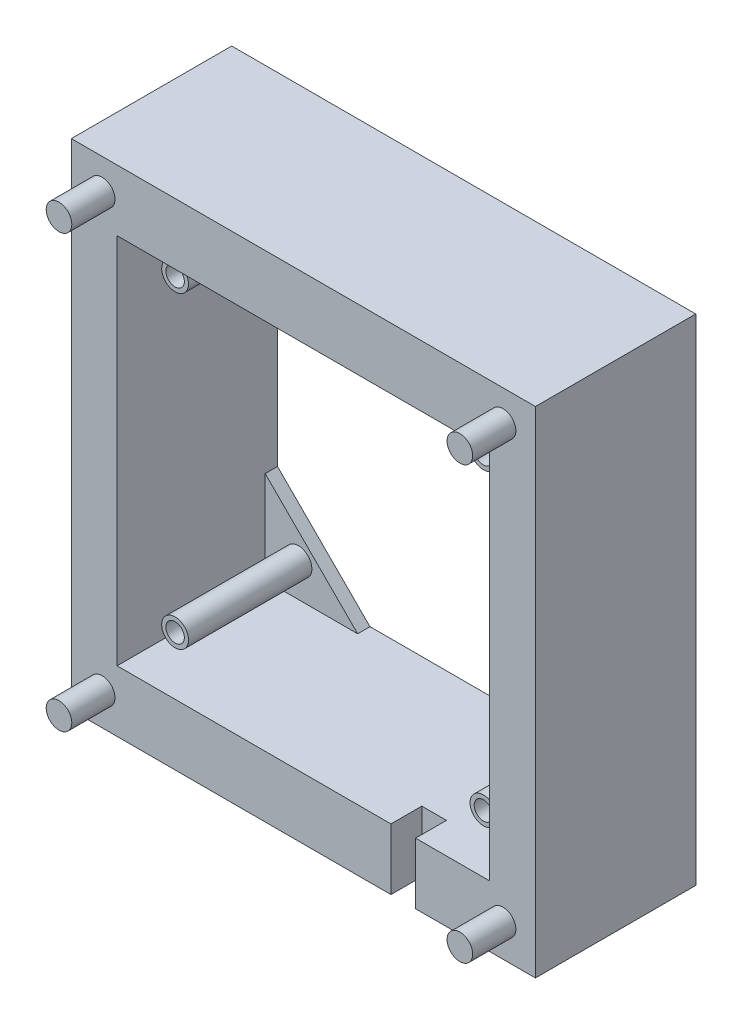
ISO-10303-21;
HEADER;
FILE_DESCRIPTION(('STEP AP214'),'2;1');
FILE_NAME('part.step','',(''),(''),'','','');
FILE_SCHEMA(('AUTOMOTIVE_DESIGN { 1 0 10303 214 1 1 1 1 }'));
ENDSEC;
DATA;
#1=APPLICATION_CONTEXT('core data for automotive mechanical design processes');
#2=APPLICATION_PROTOCOL_DEFINITION('international standard','automotive_design',2000,#1);
#3=PRODUCT_CONTEXT('',#1,'mechanical');
#4=PRODUCT('Part','Part','',(#3));
#5=PRODUCT_RELATED_PRODUCT_CATEGORY('part','',(#4));
#6=PRODUCT_DEFINITION_FORMATION('','',#4);
#7=PRODUCT_DEFINITION_CONTEXT('part definition',#1,'design');
#8=PRODUCT_DEFINITION('design','',#6,#7);
#9=PRODUCT_DEFINITION_SHAPE('','',#8);
#10=(LENGTH_UNIT() NAMED_UNIT(*) SI_UNIT(.MILLI.,.METRE.));
#11=(NAMED_UNIT(*) PLANE_ANGLE_UNIT() SI_UNIT($,.RADIAN.));
#12=(NAMED_UNIT(*) SI_UNIT($,.STERADIAN.) SOLID_ANGLE_UNIT());
#13=UNCERTAINTY_MEASURE_WITH_UNIT(LENGTH_MEASURE(1.E-05),#10,'distance_accuracy_value','');
#14=(GEOMETRIC_REPRESENTATION_CONTEXT(3) GLOBAL_UNCERTAINTY_ASSIGNED_CONTEXT((#13)) GLOBAL_UNIT_ASSIGNED_CONTEXT((#10,
#11,#12)) REPRESENTATION_CONTEXT('',''));
#15=CARTESIAN_POINT('',(0.,0.,0.));
#16=DIRECTION('',(0.,0.,1.));
#17=DIRECTION('',(1.,0.,0.));
#18=AXIS2_PLACEMENT_3D('',#15,#16,#17);
#19=CARTESIAN_POINT('',(-95.8163043478265,-19.8431159420271,-2.));
#20=DIRECTION('',(-0.707106781186543,-0.707106781186552,0.));
#21=DIRECTION('',(0.707106781186552,-0.707106781186543,0.));
#22=AXIS2_PLACEMENT_3D('',#19,#20,#21);
#23=PLANE('',#22);
#24=DIRECTION('',(0.,0.,1.));
#25=VECTOR('',#24,1.);
#26=CARTESIAN_POINT('',(-88.3913043478261,-27.2681159420274,-2.));
#27=LINE('',#26,#25);
#28=CARTESIAN_POINT('',(-88.3913043478261,-27.2681159420274,-2.));
#29=VERTEX_POINT('',#28);
#30=CARTESIAN_POINT('',(-88.3913043478261,-27.2681159420274,0.));
#31=VERTEX_POINT('',#30);
#32=EDGE_CURVE('E177',#29,#31,#27,.T.);
#33=ORIENTED_EDGE('',*,*,#32,.T.);
#34=DIRECTION('',(0.707106781186552,-0.707106781186543,0.));
#35=VECTOR('',#34,1.);
#36=CARTESIAN_POINT('',(-95.8163043478265,-19.8431159420271,0.));
#37=LINE('',#36,#35);
#38=CARTESIAN_POINT('',(-73.3913043478243,-42.268115942029,0.));
#39=VERTEX_POINT('',#38);
#40=EDGE_CURVE('E384',#31,#39,#37,.T.);
#41=ORIENTED_EDGE('',*,*,#40,.T.);
#42=DIRECTION('',(0.,0.,1.));
#43=VECTOR('',#42,1.);
#44=CARTESIAN_POINT('',(-73.3913043478243,-42.268115942029,-2.));
#45=LINE('',#44,#43);
#46=CARTESIAN_POINT('',(-73.3913043478243,-42.268115942029,-2.));
#47=VERTEX_POINT('',#46);
#48=EDGE_CURVE('E913',#47,#39,#45,.T.);
#49=ORIENTED_EDGE('',*,*,#48,.F.);
#50=DIRECTION('',(0.707106781186552,-0.707106781186543,0.));
#51=VECTOR('',#50,1.);
#52=CARTESIAN_POINT('',(-95.8163043478265,-19.8431159420271,-2.));
#53=LINE('',#52,#51);
#54=EDGE_CURVE('E385',#29,#47,#53,.T.);
#55=ORIENTED_EDGE('',*,*,#54,.F.);
#56=EDGE_LOOP('',(#33,#41,#49,#55));
#57=FACE_BOUND('',#56,.T.);
#58=ADVANCED_FACE('F33',(#57),#23,.F.);
#59=CARTESIAN_POINT('',(-63.4663043478264,28.056884057971,-2.));
#60=DIRECTION('',(-0.707106781186552,0.707106781186543,0.));
#61=DIRECTION('',(-0.707106781186543,-0.707106781186552,0.));
#62=AXIS2_PLACEMENT_3D('',#59,#60,#61);
#63=PLANE('',#62);
#64=DIRECTION('',(0.,0.,1.));
#65=VECTOR('',#64,1.);
#66=CARTESIAN_POINT('',(-88.3913043478261,3.13188405797091,-2.));
#67=LINE('',#66,#65);
#68=CARTESIAN_POINT('',(-88.3913043478261,3.13188405797091,-2.));
#69=VERTEX_POINT('',#68);
#70=CARTESIAN_POINT('',(-88.3913043478261,3.13188405797091,0.));
#71=VERTEX_POINT('',#70);
#72=EDGE_CURVE('E174',#69,#71,#67,.T.);
#73=ORIENTED_EDGE('',*,*,#72,.F.);
#74=DIRECTION('',(-0.707106781186543,-0.707106781186552,0.));
#75=VECTOR('',#74,1.);
#76=CARTESIAN_POINT('',(-63.4663043478264,28.056884057971,-2.));
#77=LINE('',#76,#75);
#78=CARTESIAN_POINT('',(-73.3913043478262,18.131884057971,-2.));
#79=VERTEX_POINT('',#78);
#80=EDGE_CURVE('E186',#79,#69,#77,.T.);
#81=ORIENTED_EDGE('',*,*,#80,.F.);
#82=DIRECTION('',(0.,0.,1.));
#83=VECTOR('',#82,1.);
#84=CARTESIAN_POINT('',(-73.3913043478262,18.131884057971,-2.));
#85=LINE('',#84,#83);
#86=CARTESIAN_POINT('',(-73.3913043478262,18.131884057971,0.));
#87=VERTEX_POINT('',#86);
#88=EDGE_CURVE('E330',#79,#87,#85,.T.);
#89=ORIENTED_EDGE('',*,*,#88,.T.);
#90=DIRECTION('',(-0.707106781186543,-0.707106781186552,0.));
#91=VECTOR('',#90,1.);
#92=CARTESIAN_POINT('',(-63.4663043478264,28.056884057971,0.));
#93=LINE('',#92,#91);
#94=EDGE_CURVE('E188',#87,#71,#93,.T.);
#95=ORIENTED_EDGE('',*,*,#94,.T.);
#96=EDGE_LOOP('',(#73,#81,#89,#95));
#97=FACE_BOUND('',#96,.T.);
#98=ADVANCED_FACE('F185',(#97),#63,.F.);
#99=CARTESIAN_POINT('',(-52.9163043478261,-52.193115942029,-2.));
#100=DIRECTION('',(0.707106781186548,-0.707106781186547,0.));
#101=DIRECTION('',(0.707106781186547,0.707106781186548,0.));
#102=AXIS2_PLACEMENT_3D('',#99,#100,#101);
#103=PLANE('',#102);
#104=DIRECTION('',(0.,0.,1.));
#105=VECTOR('',#104,1.);
#106=CARTESIAN_POINT('',(-42.9913043478261,-42.268115942029,-2.));
#107=LINE('',#106,#105);
#108=CARTESIAN_POINT('',(-42.9913043478261,-42.268115942029,-2.));
#109=VERTEX_POINT('',#108);
#110=CARTESIAN_POINT('',(-42.9913043478261,-42.268115942029,0.));
#111=VERTEX_POINT('',#110);
#112=EDGE_CURVE('E918',#109,#111,#107,.T.);
#113=ORIENTED_EDGE('',*,*,#112,.T.);
#114=DIRECTION('',(0.707106781186548,0.707106781186548,0.));
#115=VECTOR('',#114,1.);
#116=CARTESIAN_POINT('',(-52.9163043478261,-52.193115942029,0.));
#117=LINE('',#116,#115);
#118=CARTESIAN_POINT('',(-27.9913043478261,-27.2681159420289,0.));
#119=VERTEX_POINT('',#118);
#120=EDGE_CURVE('E210',#111,#119,#117,.T.);
#121=ORIENTED_EDGE('',*,*,#120,.T.);
#122=DIRECTION('',(0.,0.,1.));
#123=VECTOR('',#122,1.);
#124=CARTESIAN_POINT('',(-27.9913043478261,-27.2681159420289,-2.));
#125=LINE('',#124,#123);
#126=CARTESIAN_POINT('',(-27.9913043478261,-27.2681159420289,-2.));
#127=VERTEX_POINT('',#126);
#128=EDGE_CURVE('E923',#127,#119,#125,.T.);
#129=ORIENTED_EDGE('',*,*,#128,.F.);
#130=DIRECTION('',(0.707106781186548,0.707106781186548,0.));
#131=VECTOR('',#130,1.);
#132=CARTESIAN_POINT('',(-52.9163043478261,-52.193115942029,-2.));
#133=LINE('',#132,#131);
#134=EDGE_CURVE('E214',#109,#127,#133,.T.);
#135=ORIENTED_EDGE('',*,*,#134,.F.);
#136=EDGE_LOOP('',(#113,#121,#129,#135));
#137=FACE_BOUND('',#136,.T.);
#138=ADVANCED_FACE('F448',(#137),#103,.F.);
#139=CARTESIAN_POINT('',(-20.5663043478261,-4.29311594202901,-2.));
#140=DIRECTION('',(0.707106781186547,0.707106781186547,0.));
#141=DIRECTION('',(-0.707106781186548,0.707106781186548,0.));
#142=AXIS2_PLACEMENT_3D('',#139,#140,#141);
#143=PLANE('',#142);
#144=DIRECTION('',(0.,0.,1.));
#145=VECTOR('',#144,1.);
#146=CARTESIAN_POINT('',(-27.9913043478261,3.13188405797101,-2.));
#147=LINE('',#146,#145);
#148=CARTESIAN_POINT('',(-27.9913043478261,3.13188405797101,-2.));
#149=VERTEX_POINT('',#148);
#150=CARTESIAN_POINT('',(-27.9913043478261,3.13188405797101,0.));
#151=VERTEX_POINT('',#150);
#152=EDGE_CURVE('E48',#149,#151,#147,.T.);
#153=ORIENTED_EDGE('',*,*,#152,.T.);
#154=DIRECTION('',(-0.707106781186548,0.707106781186548,0.));
#155=VECTOR('',#154,1.);
#156=CARTESIAN_POINT('',(-20.5663043478261,-4.29311594202901,0.));
#157=LINE('',#156,#155);
#158=CARTESIAN_POINT('',(-42.9913043478261,18.131884057971,0.));
#159=VERTEX_POINT('',#158);
#160=EDGE_CURVE('E395',#151,#159,#157,.T.);
#161=ORIENTED_EDGE('',*,*,#160,.T.);
#162=DIRECTION('',(0.,0.,1.));
#163=VECTOR('',#162,1.);
#164=CARTESIAN_POINT('',(-42.9913043478261,18.131884057971,-2.));
#165=LINE('',#164,#163);
#166=CARTESIAN_POINT('',(-42.9913043478261,18.131884057971,-2.));
#167=VERTEX_POINT('',#166);
#168=EDGE_CURVE('E925',#167,#159,#165,.T.);
#169=ORIENTED_EDGE('',*,*,#168,.F.);
#170=DIRECTION('',(-0.707106781186548,0.707106781186548,0.));
#171=VECTOR('',#170,1.);
#172=CARTESIAN_POINT('',(-20.5663043478261,-4.29311594202901,-2.));
#173=LINE('',#172,#171);
#174=EDGE_CURVE('E396',#149,#167,#173,.T.);
#175=ORIENTED_EDGE('',*,*,#174,.F.);
#176=EDGE_LOOP('',(#153,#161,#169,#175));
#177=FACE_BOUND('',#176,.T.);
#178=ADVANCED_FACE('F462',(#177),#143,.F.);
#179=CARTESIAN_POINT('',(0.,0.,0.));
#180=DIRECTION('',(0.,0.,1.));
#181=DIRECTION('',(1.,0.,0.));
#182=AXIS2_PLACEMENT_3D('',#179,#180,#181);
#183=PLANE('',#182);
#184=ORIENTED_EDGE('',*,*,#40,.F.);
#185=DIRECTION('',(0.,-1.,0.));
#186=VECTOR('',#185,1.);
#187=CARTESIAN_POINT('',(-88.3913043478261,18.131884057971,0.));
#188=LINE('',#187,#186);
#189=CARTESIAN_POINT('',(-88.3913043478261,-42.268115942029,0.));
#190=VERTEX_POINT('',#189);
#191=EDGE_CURVE('E387',#31,#190,#188,.T.);
#192=ORIENTED_EDGE('',*,*,#191,.T.);
#193=DIRECTION('',(1.,0.,0.));
#194=VECTOR('',#193,1.);
#195=CARTESIAN_POINT('',(-88.3913043478261,-42.268115942029,0.));
#196=LINE('',#195,#194);
#197=EDGE_CURVE('E261',#190,#39,#196,.T.);
#198=ORIENTED_EDGE('',*,*,#197,.T.);
#199=EDGE_LOOP('',(#184,#192,#198));
#200=FACE_BOUND('',#199,.T.);
#201=CARTESIAN_POINT('',(-82.9913043478256,-36.868115942029,0.));
#202=DIRECTION('',(0.,0.,1.));
#203=DIRECTION('',(1.,0.,0.));
#204=AXIS2_PLACEMENT_3D('',#201,#202,#203);
#205=CIRCLE('',#204,2.175);
#206=CARTESIAN_POINT('',(-80.8163043478256,-36.868115942029,0.));
#207=VERTEX_POINT('',#206);
#208=EDGE_CURVE('E348',#207,#207,#205,.T.);
#209=ORIENTED_EDGE('',*,*,#208,.F.);
#210=EDGE_LOOP('',(#209));
#211=FACE_BOUND('',#210,.T.);
#212=ADVANCED_FACE('F452',(#200,#211),#183,.T.);
#213=CARTESIAN_POINT('',(0.,0.,0.));
#214=DIRECTION('',(0.,0.,1.));
#215=DIRECTION('',(1.,0.,0.));
#216=AXIS2_PLACEMENT_3D('',#213,#214,#215);
#217=PLANE('',#216);
#218=ORIENTED_EDGE('',*,*,#120,.F.);
#219=CARTESIAN_POINT('',(-27.9913043478261,-42.268115942029,0.));
#220=VERTEX_POINT('',#219);
#221=EDGE_CURVE('E260',#111,#220,#196,.T.);
#222=ORIENTED_EDGE('',*,*,#221,.T.);
#223=DIRECTION('',(0.,1.,0.));
#224=VECTOR('',#223,1.);
#225=CARTESIAN_POINT('',(-27.9913043478261,18.131884057971,0.));
#226=LINE('',#225,#224);
#227=EDGE_CURVE('E264',#220,#119,#226,.T.);
#228=ORIENTED_EDGE('',*,*,#227,.T.);
#229=EDGE_LOOP('',(#218,#222,#228));
#230=FACE_BOUND('',#229,.T.);
#231=CARTESIAN_POINT('',(-32.9913043478256,-36.8681159420283,0.));
#232=DIRECTION('',(0.,0.,1.));
#233=DIRECTION('',(1.,0.,0.));
#234=AXIS2_PLACEMENT_3D('',#231,#232,#233);
#235=CIRCLE('',#234,2.175);
#236=CARTESIAN_POINT('',(-30.8163043478256,-36.8681159420283,0.));
#237=VERTEX_POINT('',#236);
#238=EDGE_CURVE('E357',#237,#237,#235,.T.);
#239=ORIENTED_EDGE('',*,*,#238,.F.);
#240=EDGE_LOOP('',(#239));
#241=FACE_BOUND('',#240,.T.);
#242=ADVANCED_FACE('F460',(#230,#241),#217,.T.);
#243=CARTESIAN_POINT('',(0.,0.,0.));
#244=DIRECTION('',(0.,0.,1.));
#245=DIRECTION('',(1.,0.,0.));
#246=AXIS2_PLACEMENT_3D('',#243,#244,#245);
#247=PLANE('',#246);
#248=ORIENTED_EDGE('',*,*,#160,.F.);
#249=DIRECTION('',(0.,1.,0.));
#250=VECTOR('',#249,1.);
#251=CARTESIAN_POINT('',(-27.9913043478261,18.131884057971,0.));
#252=LINE('',#251,#250);
#253=CARTESIAN_POINT('',(-27.9913043478261,18.131884057971,0.));
#254=VERTEX_POINT('',#253);
#255=EDGE_CURVE('E398',#151,#254,#252,.T.);
#256=ORIENTED_EDGE('',*,*,#255,.T.);
#257=DIRECTION('',(-1.,0.,0.));
#258=VECTOR('',#257,1.);
#259=CARTESIAN_POINT('',(-88.3913043478261,18.131884057971,0.));
#260=LINE('',#259,#258);
#261=EDGE_CURVE('E249',#254,#159,#260,.T.);
#262=ORIENTED_EDGE('',*,*,#261,.T.);
#263=EDGE_LOOP('',(#248,#256,#262));
#264=FACE_BOUND('',#263,.T.);
#265=CARTESIAN_POINT('',(-32.9913043478261,13.1318840579717,0.));
#266=DIRECTION('',(0.,0.,1.));
#267=DIRECTION('',(1.,0.,0.));
#268=AXIS2_PLACEMENT_3D('',#265,#266,#267);
#269=CIRCLE('',#268,2.175);
#270=CARTESIAN_POINT('',(-30.8163043478261,13.1318840579717,0.));
#271=VERTEX_POINT('',#270);
#272=EDGE_CURVE('E366',#271,#271,#269,.T.);
#273=ORIENTED_EDGE('',*,*,#272,.F.);
#274=EDGE_LOOP('',(#273));
#275=FACE_BOUND('',#274,.T.);
#276=ADVANCED_FACE('F456',(#264,#275),#247,.T.);
#277=CARTESIAN_POINT('',(0.,0.,0.));
#278=DIRECTION('',(0.,0.,1.));
#279=DIRECTION('',(1.,0.,0.));
#280=AXIS2_PLACEMENT_3D('',#277,#278,#279);
#281=PLANE('',#280);
#282=CARTESIAN_POINT('',(-88.3913043478261,18.131884057971,0.));
#283=VERTEX_POINT('',#282);
#284=EDGE_CURVE('E267',#87,#283,#260,.T.);
#285=ORIENTED_EDGE('',*,*,#284,.T.);
#286=DIRECTION('',(0.,-1.,0.));
#287=VECTOR('',#286,1.);
#288=CARTESIAN_POINT('',(-88.3913043478261,18.131884057971,0.));
#289=LINE('',#288,#287);
#290=EDGE_CURVE('E243',#283,#71,#289,.T.);
#291=ORIENTED_EDGE('',*,*,#290,.T.);
#292=ORIENTED_EDGE('',*,*,#94,.F.);
#293=EDGE_LOOP('',(#285,#291,#292));
#294=FACE_BOUND('',#293,.T.);
#295=CARTESIAN_POINT('',(-82.9913043478261,13.131884057971,0.));
#296=DIRECTION('',(0.,0.,1.));
#297=DIRECTION('',(1.,0.,0.));
#298=AXIS2_PLACEMENT_3D('',#295,#296,#297);
#299=CIRCLE('',#298,2.175);
#300=CARTESIAN_POINT('',(-80.8163043478261,13.131884057971,0.));
#301=VERTEX_POINT('',#300);
#302=EDGE_CURVE('E375',#301,#301,#299,.T.);
#303=ORIENTED_EDGE('',*,*,#302,.F.);
#304=EDGE_LOOP('',(#303));
#305=FACE_BOUND('',#304,.T.);
#306=ADVANCED_FACE('F459',(#294,#305),#281,.T.);
#307=CARTESIAN_POINT('',(0.,0.,24.));
#308=DIRECTION('',(0.,0.,1.));
#309=DIRECTION('',(1.,0.,0.));
#310=AXIS2_PLACEMENT_3D('',#307,#308,#309);
#311=PLANE('',#310);
#312=DIRECTION('',(0.,1.,0.));
#313=VECTOR('',#312,1.);
#314=CARTESIAN_POINT('',(-39.9913043478261,-52.193115942029,24.));
#315=LINE('',#314,#313);
#316=CARTESIAN_POINT('',(-39.9913043478261,-52.193115942029,24.));
#317=VERTEX_POINT('',#316);
#318=CARTESIAN_POINT('',(-39.9913043478261,-42.268115942029,24.));
#319=VERTEX_POINT('',#318);
#320=EDGE_CURVE('E317',#317,#319,#315,.T.);
#321=ORIENTED_EDGE('',*,*,#320,.F.);
#322=DIRECTION('',(1.,0.,0.));
#323=VECTOR('',#322,1.);
#324=CARTESIAN_POINT('',(-95.8163043478261,-52.193115942029,24.));
#325=LINE('',#324,#323);
#326=CARTESIAN_POINT('',(-20.5663043478261,-52.193115942029,24.));
#327=VERTEX_POINT('',#326);
#328=EDGE_CURVE('E281',#317,#327,#325,.T.);
#329=ORIENTED_EDGE('',*,*,#328,.T.);
#330=DIRECTION('',(0.,1.,0.));
#331=VECTOR('',#330,1.);
#332=CARTESIAN_POINT('',(-20.5663043478261,28.056884057971,24.));
#333=LINE('',#332,#331);
#334=CARTESIAN_POINT('',(-20.5663043478261,28.056884057971,24.));
#335=VERTEX_POINT('',#334);
#336=EDGE_CURVE('E285',#327,#335,#333,.T.);
#337=ORIENTED_EDGE('',*,*,#336,.T.);
#338=DIRECTION('',(-1.,0.,0.));
#339=VECTOR('',#338,1.);
#340=CARTESIAN_POINT('',(-95.8163043478261,28.056884057971,24.));
#341=LINE('',#340,#339);
#342=CARTESIAN_POINT('',(-95.8163043478261,28.056884057971,24.));
#343=VERTEX_POINT('',#342);
#344=EDGE_CURVE('E287',#335,#343,#341,.T.);
#345=ORIENTED_EDGE('',*,*,#344,.T.);
#346=DIRECTION('',(0.,-1.,0.));
#347=VECTOR('',#346,1.);
#348=CARTESIAN_POINT('',(-95.8163043478261,28.056884057971,24.));
#349=LINE('',#348,#347);
#350=CARTESIAN_POINT('',(-95.8163043478261,-52.193115942029,24.));
#351=VERTEX_POINT('',#350);
#352=EDGE_CURVE('E278',#343,#351,#349,.T.);
#353=ORIENTED_EDGE('',*,*,#352,.T.);
#354=CARTESIAN_POINT('',(-43.9913043478261,-52.193115942029,24.));
#355=VERTEX_POINT('',#354);
#356=EDGE_CURVE('E282',#351,#355,#325,.T.);
#357=ORIENTED_EDGE('',*,*,#356,.T.);
#358=DIRECTION('',(0.,1.,0.));
#359=VECTOR('',#358,1.);
#360=CARTESIAN_POINT('',(-43.9913043478261,-52.193115942029,24.));
#361=LINE('',#360,#359);
#362=CARTESIAN_POINT('',(-43.9913043478261,-42.268115942029,24.));
#363=VERTEX_POINT('',#362);
#364=EDGE_CURVE('E340',#355,#363,#361,.T.);
#365=ORIENTED_EDGE('',*,*,#364,.T.);
#366=DIRECTION('',(1.,0.,0.));
#367=VECTOR('',#366,1.);
#368=CARTESIAN_POINT('',(-88.3913043478261,-42.268115942029,24.));
#369=LINE('',#368,#367);
#370=CARTESIAN_POINT('',(-88.3913043478261,-42.268115942029,24.));
#371=VERTEX_POINT('',#370);
#372=EDGE_CURVE('E250',#371,#363,#369,.T.);
#373=ORIENTED_EDGE('',*,*,#372,.F.);
#374=DIRECTION('',(0.,-1.,0.));
#375=VECTOR('',#374,1.);
#376=CARTESIAN_POINT('',(-88.3913043478261,18.131884057971,24.));
#377=LINE('',#376,#375);
#378=CARTESIAN_POINT('',(-88.3913043478261,18.131884057971,24.));
#379=VERTEX_POINT('',#378);
#380=EDGE_CURVE('E246',#379,#371,#377,.T.);
#381=ORIENTED_EDGE('',*,*,#380,.F.);
#382=DIRECTION('',(-1.,0.,0.));
#383=VECTOR('',#382,1.);
#384=CARTESIAN_POINT('',(-88.3913043478261,18.131884057971,24.));
#385=LINE('',#384,#383);
#386=CARTESIAN_POINT('',(-27.9913043478261,18.131884057971,24.));
#387=VERTEX_POINT('',#386);
#388=EDGE_CURVE('E256',#387,#379,#385,.T.);
#389=ORIENTED_EDGE('',*,*,#388,.F.);
#390=DIRECTION('',(0.,1.,0.));
#391=VECTOR('',#390,1.);
#392=CARTESIAN_POINT('',(-27.9913043478261,18.131884057971,24.));
#393=LINE('',#392,#391);
#394=CARTESIAN_POINT('',(-27.9913043478261,-42.268115942029,24.));
#395=VERTEX_POINT('',#394);
#396=EDGE_CURVE('E253',#395,#387,#393,.T.);
#397=ORIENTED_EDGE('',*,*,#396,.F.);
#398=EDGE_CURVE('E248',#319,#395,#369,.T.);
#399=ORIENTED_EDGE('',*,*,#398,.F.);
#400=EDGE_LOOP('',(#321,#329,#337,#345,#353,#357,#365,#373,#381,#389,#397,#399));
#401=FACE_BOUND('',#400,.T.);
#402=CARTESIAN_POINT('',(-90.8163043478254,-46.943115942029,24.));
#403=DIRECTION('',(0.,0.,1.));
#404=DIRECTION('',(1.,0.,0.));
#405=AXIS2_PLACEMENT_3D('',#402,#403,#404);
#406=CIRCLE('',#405,2.07499999999999);
#407=CARTESIAN_POINT('',(-88.7413043478254,-46.943115942029,24.));
#408=VERTEX_POINT('',#407);
#409=EDGE_CURVE('E219',#408,#408,#406,.T.);
#410=ORIENTED_EDGE('',*,*,#409,.F.);
#411=EDGE_LOOP('',(#410));
#412=FACE_BOUND('',#411,.T.);
#413=CARTESIAN_POINT('',(-25.8163043478254,-46.943115942029,24.));
#414=DIRECTION('',(0.,0.,1.));
#415=DIRECTION('',(1.,0.,0.));
#416=AXIS2_PLACEMENT_3D('',#413,#414,#415);
#417=CIRCLE('',#416,2.075);
#418=CARTESIAN_POINT('',(-23.7413043478253,-46.943115942029,24.));
#419=VERTEX_POINT('',#418);
#420=EDGE_CURVE('E225',#419,#419,#417,.T.);
#421=ORIENTED_EDGE('',*,*,#420,.F.);
#422=EDGE_LOOP('',(#421));
#423=FACE_BOUND('',#422,.T.);
#424=CARTESIAN_POINT('',(-25.8163043478261,23.056884057971,24.));
#425=DIRECTION('',(0.,0.,1.));
#426=DIRECTION('',(1.,0.,0.));
#427=AXIS2_PLACEMENT_3D('',#424,#425,#426);
#428=CIRCLE('',#427,2.075);
#429=CARTESIAN_POINT('',(-23.7413043478261,23.056884057971,24.));
#430=VERTEX_POINT('',#429);
#431=EDGE_CURVE('E231',#430,#430,#428,.T.);
#432=ORIENTED_EDGE('',*,*,#431,.F.);
#433=EDGE_LOOP('',(#432));
#434=FACE_BOUND('',#433,.T.);
#435=CARTESIAN_POINT('',(-90.8163043478261,23.056884057971,24.));
#436=DIRECTION('',(0.,0.,1.));
#437=DIRECTION('',(1.,0.,0.));
#438=AXIS2_PLACEMENT_3D('',#435,#436,#437);
#439=CIRCLE('',#438,2.07499999999999);
#440=CARTESIAN_POINT('',(-88.7413043478261,23.056884057971,24.));
#441=VERTEX_POINT('',#440);
#442=EDGE_CURVE('E237',#441,#441,#439,.T.);
#443=ORIENTED_EDGE('',*,*,#442,.F.);
#444=EDGE_LOOP('',(#443));
#445=FACE_BOUND('',#444,.T.);
#446=ADVANCED_FACE('F314',(#401,#412,#423,#434,#445),#311,.T.);
#447=CARTESIAN_POINT('',(-95.8163043478261,28.056884057971,24.));
#448=DIRECTION('',(1.,0.,0.));
#449=DIRECTION('',(0.,1.,0.));
#450=AXIS2_PLACEMENT_3D('',#447,#448,#449);
#451=PLANE('',#450);
#452=DIRECTION('',(0.,0.,-1.));
#453=VECTOR('',#452,1.);
#454=CARTESIAN_POINT('',(-95.8163043478261,28.056884057971,24.));
#455=LINE('',#454,#453);
#456=CARTESIAN_POINT('',(-95.8163043478264,28.0568840579708,-2.));
#457=VERTEX_POINT('',#456);
#458=EDGE_CURVE('E289',#343,#457,#455,.T.);
#459=ORIENTED_EDGE('',*,*,#458,.T.);
#460=DIRECTION('',(0.,1.,0.));
#461=VECTOR('',#460,1.);
#462=CARTESIAN_POINT('',(-95.8163043478261,-4.29311594202926,-2.));
#463=LINE('',#462,#461);
#464=CARTESIAN_POINT('',(-95.8163043478263,-52.1931159420271,-2.));
#465=VERTEX_POINT('',#464);
#466=EDGE_CURVE('E196',#465,#457,#463,.T.);
#467=ORIENTED_EDGE('',*,*,#466,.F.);
#468=DIRECTION('',(0.,0.,-1.));
#469=VECTOR('',#468,1.);
#470=CARTESIAN_POINT('',(-95.8163043478261,-52.193115942029,24.));
#471=LINE('',#470,#469);
#472=EDGE_CURVE('E11',#351,#465,#471,.T.);
#473=ORIENTED_EDGE('',*,*,#472,.F.);
#474=ORIENTED_EDGE('',*,*,#352,.F.);
#475=EDGE_LOOP('',(#459,#467,#473,#474));
#476=FACE_BOUND('',#475,.T.);
#477=ADVANCED_FACE('F35',(#476),#451,.F.);
#478=CARTESIAN_POINT('',(-95.8163043478261,-52.193115942029,24.));
#479=DIRECTION('',(0.,1.,0.));
#480=DIRECTION('',(-1.,0.,0.));
#481=AXIS2_PLACEMENT_3D('',#478,#479,#480);
#482=PLANE('',#481);
#483=ORIENTED_EDGE('',*,*,#472,.T.);
#484=DIRECTION('',(-1.,0.,0.));
#485=VECTOR('',#484,1.);
#486=CARTESIAN_POINT('',(-20.5663043478261,-52.193115942029,-2.));
#487=LINE('',#486,#485);
#488=CARTESIAN_POINT('',(-20.5663043478261,-52.193115942029,-2.));
#489=VERTEX_POINT('',#488);
#490=EDGE_CURVE('E211',#489,#465,#487,.T.);
#491=ORIENTED_EDGE('',*,*,#490,.F.);
#492=DIRECTION('',(0.,0.,-1.));
#493=VECTOR('',#492,1.);
#494=CARTESIAN_POINT('',(-20.5663043478261,-52.193115942029,24.));
#495=LINE('',#494,#493);
#496=EDGE_CURVE('E41',#327,#489,#495,.T.);
#497=ORIENTED_EDGE('',*,*,#496,.F.);
#498=ORIENTED_EDGE('',*,*,#328,.F.);
#499=DIRECTION('',(0.,0.,-1.));
#500=VECTOR('',#499,1.);
#501=CARTESIAN_POINT('',(-39.9913043478261,-52.193115942029,24.));
#502=LINE('',#501,#500);
#503=CARTESIAN_POINT('',(-39.9913043478261,-52.193115942029,19.));
#504=VERTEX_POINT('',#503);
#505=EDGE_CURVE('E320',#317,#504,#502,.T.);
#506=ORIENTED_EDGE('',*,*,#505,.T.);
#507=DIRECTION('',(-1.,0.,0.));
#508=VECTOR('',#507,1.);
#509=CARTESIAN_POINT('',(-39.9913043478261,-52.193115942029,19.));
#510=LINE('',#509,#508);
#511=CARTESIAN_POINT('',(-43.9913043478261,-52.193115942029,19.));
#512=VERTEX_POINT('',#511);
#513=EDGE_CURVE('E322',#504,#512,#510,.T.);
#514=ORIENTED_EDGE('',*,*,#513,.T.);
#515=DIRECTION('',(0.,0.,1.));
#516=VECTOR('',#515,1.);
#517=CARTESIAN_POINT('',(-43.9913043478261,-52.193115942029,24.));
#518=LINE('',#517,#516);
#519=EDGE_CURVE('E325',#512,#355,#518,.T.);
#520=ORIENTED_EDGE('',*,*,#519,.T.);
#521=ORIENTED_EDGE('',*,*,#356,.F.);
#522=EDGE_LOOP('',(#483,#491,#497,#498,#506,#514,#520,#521));
#523=FACE_BOUND('',#522,.T.);
#524=ADVANCED_FACE('F303',(#523),#482,.F.);
#525=CARTESIAN_POINT('',(-20.5663043478261,28.056884057971,24.));
#526=DIRECTION('',(-1.,0.,0.));
#527=DIRECTION('',(0.,-1.,0.));
#528=AXIS2_PLACEMENT_3D('',#525,#526,#527);
#529=PLANE('',#528);
#530=DIRECTION('',(0.,-1.,0.));
#531=VECTOR('',#530,1.);
#532=CARTESIAN_POINT('',(-20.5663043478261,-19.843115942029,-2.));
#533=LINE('',#532,#531);
#534=CARTESIAN_POINT('',(-20.5663043478261,28.056884057971,-2.));
#535=VERTEX_POINT('',#534);
#536=EDGE_CURVE('E216',#535,#489,#533,.T.);
#537=ORIENTED_EDGE('',*,*,#536,.F.);
#538=DIRECTION('',(0.,0.,-1.));
#539=VECTOR('',#538,1.);
#540=CARTESIAN_POINT('',(-20.5663043478261,28.056884057971,24.));
#541=LINE('',#540,#539);
#542=EDGE_CURVE('E291',#335,#535,#541,.T.);
#543=ORIENTED_EDGE('',*,*,#542,.F.);
#544=ORIENTED_EDGE('',*,*,#336,.F.);
#545=ORIENTED_EDGE('',*,*,#496,.T.);
#546=EDGE_LOOP('',(#537,#543,#544,#545));
#547=FACE_BOUND('',#546,.T.);
#548=ADVANCED_FACE('F296',(#547),#529,.F.);
#549=CARTESIAN_POINT('',(-95.8163043478261,28.056884057971,24.));
#550=DIRECTION('',(0.,-1.,0.));
#551=DIRECTION('',(0.,0.,-1.));
#552=AXIS2_PLACEMENT_3D('',#549,#550,#551);
#553=PLANE('',#552);
#554=ORIENTED_EDGE('',*,*,#542,.T.);
#555=DIRECTION('',(1.,0.,0.));
#556=VECTOR('',#555,1.);
#557=CARTESIAN_POINT('',(-95.8163043478264,28.0568840579708,-2.));
#558=LINE('',#557,#556);
#559=EDGE_CURVE('E197',#457,#535,#558,.T.);
#560=ORIENTED_EDGE('',*,*,#559,.F.);
#561=ORIENTED_EDGE('',*,*,#458,.F.);
#562=ORIENTED_EDGE('',*,*,#344,.F.);
#563=EDGE_LOOP('',(#554,#560,#561,#562));
#564=FACE_BOUND('',#563,.T.);
#565=ADVANCED_FACE('F310',(#564),#553,.F.);
#566=CARTESIAN_POINT('',(-88.3913043478261,18.131884057971,24.));
#567=DIRECTION('',(1.,0.,0.));
#568=DIRECTION('',(0.,0.,-1.));
#569=AXIS2_PLACEMENT_3D('',#566,#567,#568);
#570=PLANE('',#569);
#571=ORIENTED_EDGE('',*,*,#290,.F.);
#572=DIRECTION('',(0.,0.,-1.));
#573=VECTOR('',#572,1.);
#574=CARTESIAN_POINT('',(-88.3913043478261,18.131884057971,24.));
#575=LINE('',#574,#573);
#576=EDGE_CURVE('E258',#379,#283,#575,.T.);
#577=ORIENTED_EDGE('',*,*,#576,.F.);
#578=ORIENTED_EDGE('',*,*,#380,.T.);
#579=DIRECTION('',(0.,0.,-1.));
#580=VECTOR('',#579,1.);
#581=CARTESIAN_POINT('',(-88.3913043478261,-42.268115942029,24.));
#582=LINE('',#581,#580);
#583=EDGE_CURVE('E275',#371,#190,#582,.T.);
#584=ORIENTED_EDGE('',*,*,#583,.T.);
#585=ORIENTED_EDGE('',*,*,#191,.F.);
#586=ORIENTED_EDGE('',*,*,#32,.F.);
#587=DIRECTION('',(0.,-1.,0.));
#588=VECTOR('',#587,1.);
#589=CARTESIAN_POINT('',(-88.3913043478261,-27.2681159420274,-2.));
#590=LINE('',#589,#588);
#591=EDGE_CURVE('E170',#69,#29,#590,.T.);
#592=ORIENTED_EDGE('',*,*,#591,.F.);
#593=ORIENTED_EDGE('',*,*,#72,.T.);
#594=EDGE_LOOP('',(#571,#577,#578,#584,#585,#586,#592,#593));
#595=FACE_BOUND('',#594,.T.);
#596=ADVANCED_FACE('F173',(#595),#570,.T.);
#597=CARTESIAN_POINT('',(-88.3913043478261,-42.268115942029,24.));
#598=DIRECTION('',(0.,1.,0.));
#599=DIRECTION('',(0.,0.,1.));
#600=AXIS2_PLACEMENT_3D('',#597,#598,#599);
#601=PLANE('',#600);
#602=DIRECTION('',(0.,0.,-1.));
#603=VECTOR('',#602,1.);
#604=CARTESIAN_POINT('',(-39.9913043478261,-42.268115942029,24.));
#605=LINE('',#604,#603);
#606=CARTESIAN_POINT('',(-39.9913043478261,-42.268115942029,19.));
#607=VERTEX_POINT('',#606);
#608=EDGE_CURVE('E56',#319,#607,#605,.T.);
#609=ORIENTED_EDGE('',*,*,#608,.F.);
#610=ORIENTED_EDGE('',*,*,#398,.T.);
#611=DIRECTION('',(0.,0.,-1.));
#612=VECTOR('',#611,1.);
#613=CARTESIAN_POINT('',(-27.9913043478261,-42.268115942029,24.));
#614=LINE('',#613,#612);
#615=EDGE_CURVE('E273',#395,#220,#614,.T.);
#616=ORIENTED_EDGE('',*,*,#615,.T.);
#617=ORIENTED_EDGE('',*,*,#221,.F.);
#618=ORIENTED_EDGE('',*,*,#112,.F.);
#619=DIRECTION('',(1.,0.,0.));
#620=VECTOR('',#619,1.);
#621=CARTESIAN_POINT('',(-73.3913043478243,-42.268115942029,-2.));
#622=LINE('',#621,#620);
#623=EDGE_CURVE('E189',#47,#109,#622,.T.);
#624=ORIENTED_EDGE('',*,*,#623,.F.);
#625=ORIENTED_EDGE('',*,*,#48,.T.);
#626=ORIENTED_EDGE('',*,*,#197,.F.);
#627=ORIENTED_EDGE('',*,*,#583,.F.);
#628=ORIENTED_EDGE('',*,*,#372,.T.);
#629=DIRECTION('',(0.,0.,1.));
#630=VECTOR('',#629,1.);
#631=CARTESIAN_POINT('',(-43.9913043478261,-42.268115942029,24.));
#632=LINE('',#631,#630);
#633=CARTESIAN_POINT('',(-43.9913043478261,-42.268115942029,19.));
#634=VERTEX_POINT('',#633);
#635=EDGE_CURVE('E323',#634,#363,#632,.T.);
#636=ORIENTED_EDGE('',*,*,#635,.F.);
#637=DIRECTION('',(-1.,0.,0.));
#638=VECTOR('',#637,1.);
#639=CARTESIAN_POINT('',(-39.9913043478261,-42.268115942029,19.));
#640=LINE('',#639,#638);
#641=EDGE_CURVE('E327',#607,#634,#640,.T.);
#642=ORIENTED_EDGE('',*,*,#641,.F.);
#643=EDGE_LOOP('',(#609,#610,#616,#617,#618,#624,#625,#626,#627,#628,#636,#642));
#644=FACE_BOUND('',#643,.T.);
#645=ADVANCED_FACE('F518',(#644),#601,.T.);
#646=CARTESIAN_POINT('',(-27.9913043478261,18.131884057971,24.));
#647=DIRECTION('',(-1.,0.,0.));
#648=DIRECTION('',(0.,-1.,0.));
#649=AXIS2_PLACEMENT_3D('',#646,#647,#648);
#650=PLANE('',#649);
#651=ORIENTED_EDGE('',*,*,#227,.F.);
#652=ORIENTED_EDGE('',*,*,#615,.F.);
#653=ORIENTED_EDGE('',*,*,#396,.T.);
#654=DIRECTION('',(0.,0.,-1.));
#655=VECTOR('',#654,1.);
#656=CARTESIAN_POINT('',(-27.9913043478261,18.131884057971,24.));
#657=LINE('',#656,#655);
#658=EDGE_CURVE('E271',#387,#254,#657,.T.);
#659=ORIENTED_EDGE('',*,*,#658,.T.);
#660=ORIENTED_EDGE('',*,*,#255,.F.);
#661=ORIENTED_EDGE('',*,*,#152,.F.);
#662=DIRECTION('',(0.,1.,0.));
#663=VECTOR('',#662,1.);
#664=CARTESIAN_POINT('',(-27.9913043478261,3.13188405797101,-2.));
#665=LINE('',#664,#663);
#666=EDGE_CURVE('E920',#127,#149,#665,.T.);
#667=ORIENTED_EDGE('',*,*,#666,.F.);
#668=ORIENTED_EDGE('',*,*,#128,.T.);
#669=EDGE_LOOP('',(#651,#652,#653,#659,#660,#661,#667,#668));
#670=FACE_BOUND('',#669,.T.);
#671=ADVANCED_FACE('F514',(#670),#650,.T.);
#672=CARTESIAN_POINT('',(-88.3913043478261,18.131884057971,24.));
#673=DIRECTION('',(0.,-1.,0.));
#674=DIRECTION('',(0.,0.,-1.));
#675=AXIS2_PLACEMENT_3D('',#672,#673,#674);
#676=PLANE('',#675);
#677=ORIENTED_EDGE('',*,*,#261,.F.);
#678=ORIENTED_EDGE('',*,*,#658,.F.);
#679=ORIENTED_EDGE('',*,*,#388,.T.);
#680=ORIENTED_EDGE('',*,*,#576,.T.);
#681=ORIENTED_EDGE('',*,*,#284,.F.);
#682=ORIENTED_EDGE('',*,*,#88,.F.);
#683=DIRECTION('',(-1.,0.,0.));
#684=VECTOR('',#683,1.);
#685=CARTESIAN_POINT('',(-73.3913043478262,18.131884057971,-2.));
#686=LINE('',#685,#684);
#687=EDGE_CURVE('E194',#167,#79,#686,.T.);
#688=ORIENTED_EDGE('',*,*,#687,.F.);
#689=ORIENTED_EDGE('',*,*,#168,.T.);
#690=EDGE_LOOP('',(#677,#678,#679,#680,#681,#682,#688,#689));
#691=FACE_BOUND('',#690,.T.);
#692=ADVANCED_FACE('F510',(#691),#676,.T.);
#693=CARTESIAN_POINT('',(-90.8163043478261,23.056884057971,31.));
#694=DIRECTION('',(0.,0.,-1.));
#695=DIRECTION('',(-1.,0.,0.));
#696=AXIS2_PLACEMENT_3D('',#693,#694,#695);
#697=CYLINDRICAL_SURFACE('',#696,2.07499999999999);
#698=CARTESIAN_POINT('',(-90.8163043478261,23.056884057971,31.));
#699=DIRECTION('',(0.,0.,1.));
#700=DIRECTION('',(1.,0.,0.));
#701=AXIS2_PLACEMENT_3D('',#698,#699,#700);
#702=CIRCLE('',#701,2.07499999999999);
#703=CARTESIAN_POINT('',(-88.7413043478261,23.056884057971,31.));
#704=VERTEX_POINT('',#703);
#705=EDGE_CURVE('E240',#704,#704,#702,.T.);
#706=ORIENTED_EDGE('',*,*,#705,.F.);
#707=EDGE_LOOP('',(#706));
#708=FACE_BOUND('',#707,.T.);
#709=ORIENTED_EDGE('',*,*,#442,.T.);
#710=EDGE_LOOP('',(#709));
#711=FACE_BOUND('',#710,.T.);
#712=ADVANCED_FACE('F506',(#708,#711),#697,.T.);
#713=CARTESIAN_POINT('',(-90.8163043478261,23.056884057971,31.));
#714=DIRECTION('',(0.,0.,1.));
#715=DIRECTION('',(1.,0.,0.));
#716=AXIS2_PLACEMENT_3D('',#713,#714,#715);
#717=PLANE('',#716);
#718=ORIENTED_EDGE('',*,*,#705,.T.);
#719=EDGE_LOOP('',(#718));
#720=FACE_BOUND('',#719,.T.);
#721=ADVANCED_FACE('F502',(#720),#717,.T.);
#722=CARTESIAN_POINT('',(-25.8163043478261,23.056884057971,31.));
#723=DIRECTION('',(0.,0.,-1.));
#724=DIRECTION('',(-1.,0.,0.));
#725=AXIS2_PLACEMENT_3D('',#722,#723,#724);
#726=CYLINDRICAL_SURFACE('',#725,2.075);
#727=CARTESIAN_POINT('',(-25.8163043478261,23.056884057971,31.));
#728=DIRECTION('',(0.,0.,1.));
#729=DIRECTION('',(1.,0.,0.));
#730=AXIS2_PLACEMENT_3D('',#727,#728,#729);
#731=CIRCLE('',#730,2.075);
#732=CARTESIAN_POINT('',(-23.7413043478261,23.056884057971,31.));
#733=VERTEX_POINT('',#732);
#734=EDGE_CURVE('E234',#733,#733,#731,.T.);
#735=ORIENTED_EDGE('',*,*,#734,.F.);
#736=EDGE_LOOP('',(#735));
#737=FACE_BOUND('',#736,.T.);
#738=ORIENTED_EDGE('',*,*,#431,.T.);
#739=EDGE_LOOP('',(#738));
#740=FACE_BOUND('',#739,.T.);
#741=ADVANCED_FACE('F498',(#737,#740),#726,.T.);
#742=CARTESIAN_POINT('',(-25.8163043478261,23.056884057971,31.));
#743=DIRECTION('',(0.,0.,1.));
#744=DIRECTION('',(1.,0.,0.));
#745=AXIS2_PLACEMENT_3D('',#742,#743,#744);
#746=PLANE('',#745);
#747=ORIENTED_EDGE('',*,*,#734,.T.);
#748=EDGE_LOOP('',(#747));
#749=FACE_BOUND('',#748,.T.);
#750=ADVANCED_FACE('F494',(#749),#746,.T.);
#751=CARTESIAN_POINT('',(-25.8163043478254,-46.943115942029,31.));
#752=DIRECTION('',(0.,0.,-1.));
#753=DIRECTION('',(-1.,0.,0.));
#754=AXIS2_PLACEMENT_3D('',#751,#752,#753);
#755=CYLINDRICAL_SURFACE('',#754,2.075);
#756=CARTESIAN_POINT('',(-25.8163043478254,-46.943115942029,31.));
#757=DIRECTION('',(0.,0.,1.));
#758=DIRECTION('',(1.,0.,0.));
#759=AXIS2_PLACEMENT_3D('',#756,#757,#758);
#760=CIRCLE('',#759,2.075);
#761=CARTESIAN_POINT('',(-23.7413043478253,-46.943115942029,31.));
#762=VERTEX_POINT('',#761);
#763=EDGE_CURVE('E228',#762,#762,#760,.T.);
#764=ORIENTED_EDGE('',*,*,#763,.F.);
#765=EDGE_LOOP('',(#764));
#766=FACE_BOUND('',#765,.T.);
#767=ORIENTED_EDGE('',*,*,#420,.T.);
#768=EDGE_LOOP('',(#767));
#769=FACE_BOUND('',#768,.T.);
#770=ADVANCED_FACE('F490',(#766,#769),#755,.T.);
#771=CARTESIAN_POINT('',(-25.8163043478254,-46.943115942029,31.));
#772=DIRECTION('',(0.,0.,1.));
#773=DIRECTION('',(1.,0.,0.));
#774=AXIS2_PLACEMENT_3D('',#771,#772,#773);
#775=PLANE('',#774);
#776=ORIENTED_EDGE('',*,*,#763,.T.);
#777=EDGE_LOOP('',(#776));
#778=FACE_BOUND('',#777,.T.);
#779=ADVANCED_FACE('F486',(#778),#775,.T.);
#780=CARTESIAN_POINT('',(-90.8163043478254,-46.943115942029,31.));
#781=DIRECTION('',(0.,0.,-1.));
#782=DIRECTION('',(-1.,0.,0.));
#783=AXIS2_PLACEMENT_3D('',#780,#781,#782);
#784=CYLINDRICAL_SURFACE('',#783,2.07499999999999);
#785=CARTESIAN_POINT('',(-90.8163043478254,-46.943115942029,31.));
#786=DIRECTION('',(0.,0.,1.));
#787=DIRECTION('',(1.,0.,0.));
#788=AXIS2_PLACEMENT_3D('',#785,#786,#787);
#789=CIRCLE('',#788,2.07499999999999);
#790=CARTESIAN_POINT('',(-88.7413043478254,-46.943115942029,31.));
#791=VERTEX_POINT('',#790);
#792=EDGE_CURVE('E222',#791,#791,#789,.T.);
#793=ORIENTED_EDGE('',*,*,#792,.F.);
#794=EDGE_LOOP('',(#793));
#795=FACE_BOUND('',#794,.T.);
#796=ORIENTED_EDGE('',*,*,#409,.T.);
#797=EDGE_LOOP('',(#796));
#798=FACE_BOUND('',#797,.T.);
#799=ADVANCED_FACE('F482',(#795,#798),#784,.T.);
#800=CARTESIAN_POINT('',(-90.8163043478254,-46.943115942029,31.));
#801=DIRECTION('',(0.,0.,1.));
#802=DIRECTION('',(1.,0.,0.));
#803=AXIS2_PLACEMENT_3D('',#800,#801,#802);
#804=PLANE('',#803);
#805=ORIENTED_EDGE('',*,*,#792,.T.);
#806=EDGE_LOOP('',(#805));
#807=FACE_BOUND('',#806,.T.);
#808=ADVANCED_FACE('F411',(#807),#804,.T.);
#809=CARTESIAN_POINT('',(0.,0.,-2.));
#810=DIRECTION('',(0.,0.,1.));
#811=DIRECTION('',(1.,0.,0.));
#812=AXIS2_PLACEMENT_3D('',#809,#810,#811);
#813=PLANE('',#812);
#814=ORIENTED_EDGE('',*,*,#591,.T.);
#815=ORIENTED_EDGE('',*,*,#54,.T.);
#816=ORIENTED_EDGE('',*,*,#623,.T.);
#817=ORIENTED_EDGE('',*,*,#134,.T.);
#818=ORIENTED_EDGE('',*,*,#666,.T.);
#819=ORIENTED_EDGE('',*,*,#174,.T.);
#820=ORIENTED_EDGE('',*,*,#687,.T.);
#821=ORIENTED_EDGE('',*,*,#80,.T.);
#822=EDGE_LOOP('',(#814,#815,#816,#817,#818,#819,#820,#821));
#823=FACE_BOUND('',#822,.T.);
#824=ORIENTED_EDGE('',*,*,#490,.T.);
#825=ORIENTED_EDGE('',*,*,#466,.T.);
#826=ORIENTED_EDGE('',*,*,#559,.T.);
#827=ORIENTED_EDGE('',*,*,#536,.T.);
#828=EDGE_LOOP('',(#824,#825,#826,#827));
#829=FACE_BOUND('',#828,.T.);
#830=CARTESIAN_POINT('',(-32.9913043478266,-36.868115942029,-2.));
#831=DIRECTION('',(0.,0.,-1.));
#832=DIRECTION('',(-1.,0.,0.));
#833=AXIS2_PLACEMENT_3D('',#830,#831,#832);
#834=CIRCLE('',#833,1.5);
#835=CARTESIAN_POINT('',(-34.4913043478266,-36.868115942029,-2.));
#836=VERTEX_POINT('',#835);
#837=EDGE_CURVE('E200',#836,#836,#834,.T.);
#838=ORIENTED_EDGE('',*,*,#837,.F.);
#839=EDGE_LOOP('',(#838));
#840=FACE_BOUND('',#839,.T.);
#841=CARTESIAN_POINT('',(-82.9913043478261,13.131884057971,-2.));
#842=DIRECTION('',(0.,0.,-1.));
#843=DIRECTION('',(-1.,0.,0.));
#844=AXIS2_PLACEMENT_3D('',#841,#842,#843);
#845=CIRCLE('',#844,1.5);
#846=CARTESIAN_POINT('',(-84.4913043478261,13.131884057971,-2.));
#847=VERTEX_POINT('',#846);
#848=EDGE_CURVE('E207',#847,#847,#845,.T.);
#849=ORIENTED_EDGE('',*,*,#848,.F.);
#850=EDGE_LOOP('',(#849));
#851=FACE_BOUND('',#850,.T.);
#852=CARTESIAN_POINT('',(-32.9913043478261,13.131884057971,-2.));
#853=DIRECTION('',(0.,0.,-1.));
#854=DIRECTION('',(-1.,0.,0.));
#855=AXIS2_PLACEMENT_3D('',#852,#853,#854);
#856=CIRCLE('',#855,1.5);
#857=CARTESIAN_POINT('',(-34.4913043478261,13.131884057971,-2.));
#858=VERTEX_POINT('',#857);
#859=EDGE_CURVE('E392',#858,#858,#856,.T.);
#860=ORIENTED_EDGE('',*,*,#859,.F.);
#861=EDGE_LOOP('',(#860));
#862=FACE_BOUND('',#861,.T.);
#863=CARTESIAN_POINT('',(-82.9913043478266,-36.868115942029,-2.));
#864=DIRECTION('',(0.,0.,-1.));
#865=DIRECTION('',(-1.,0.,0.));
#866=AXIS2_PLACEMENT_3D('',#863,#864,#865);
#867=CIRCLE('',#866,1.5);
#868=CARTESIAN_POINT('',(-84.4913043478266,-36.868115942029,-2.));
#869=VERTEX_POINT('',#868);
#870=EDGE_CURVE('E379',#869,#869,#867,.T.);
#871=ORIENTED_EDGE('',*,*,#870,.F.);
#872=EDGE_LOOP('',(#871));
#873=FACE_BOUND('',#872,.T.);
#874=ADVANCED_FACE('F191',(#823,#829,#840,#851,#862,#873),#813,.F.);
#875=CARTESIAN_POINT('',(-32.9913043478266,-36.868115942029,-2.));
#876=DIRECTION('',(0.,0.,1.));
#877=DIRECTION('',(1.,0.,0.));
#878=AXIS2_PLACEMENT_3D('',#875,#876,#877);
#879=CYLINDRICAL_SURFACE('',#878,1.5);
#880=ORIENTED_EDGE('',*,*,#837,.T.);
#881=EDGE_LOOP('',(#880));
#882=FACE_BOUND('',#881,.T.);
#883=CARTESIAN_POINT('',(-32.9913043478256,-36.8681159420283,20.));
#884=DIRECTION('',(0.,0.,1.));
#885=DIRECTION('',(1.,0.,0.));
#886=AXIS2_PLACEMENT_3D('',#883,#884,#885);
#887=CIRCLE('',#886,1.5);
#888=CARTESIAN_POINT('',(-31.4913043478256,-36.8681159420283,20.));
#889=VERTEX_POINT('',#888);
#890=EDGE_CURVE('E352',#889,#889,#887,.T.);
#891=ORIENTED_EDGE('',*,*,#890,.T.);
#892=EDGE_LOOP('',(#891));
#893=FACE_BOUND('',#892,.T.);
#894=ADVANCED_FACE('F410',(#882,#893),#879,.F.);
#895=CARTESIAN_POINT('',(-82.9913043478261,13.131884057971,-2.));
#896=DIRECTION('',(0.,0.,1.));
#897=DIRECTION('',(1.,0.,0.));
#898=AXIS2_PLACEMENT_3D('',#895,#896,#897);
#899=CYLINDRICAL_SURFACE('',#898,1.5);
#900=ORIENTED_EDGE('',*,*,#848,.T.);
#901=EDGE_LOOP('',(#900));
#902=FACE_BOUND('',#901,.T.);
#903=CARTESIAN_POINT('',(-82.9913043478261,13.131884057971,20.));
#904=DIRECTION('',(0.,0.,1.));
#905=DIRECTION('',(1.,0.,0.));
#906=AXIS2_PLACEMENT_3D('',#903,#904,#905);
#907=CIRCLE('',#906,1.5);
#908=CARTESIAN_POINT('',(-81.4913043478261,13.131884057971,20.));
#909=VERTEX_POINT('',#908);
#910=EDGE_CURVE('E370',#909,#909,#907,.T.);
#911=ORIENTED_EDGE('',*,*,#910,.T.);
#912=EDGE_LOOP('',(#911));
#913=FACE_BOUND('',#912,.T.);
#914=ADVANCED_FACE('F405',(#902,#913),#899,.F.);
#915=CARTESIAN_POINT('',(-32.9913043478261,13.131884057971,-2.));
#916=DIRECTION('',(0.,0.,1.));
#917=DIRECTION('',(1.,0.,0.));
#918=AXIS2_PLACEMENT_3D('',#915,#916,#917);
#919=CYLINDRICAL_SURFACE('',#918,1.5);
#920=ORIENTED_EDGE('',*,*,#859,.T.);
#921=EDGE_LOOP('',(#920));
#922=FACE_BOUND('',#921,.T.);
#923=CARTESIAN_POINT('',(-32.9913043478261,13.1318840579717,20.));
#924=DIRECTION('',(0.,0.,1.));
#925=DIRECTION('',(1.,0.,0.));
#926=AXIS2_PLACEMENT_3D('',#923,#924,#925);
#927=CIRCLE('',#926,1.5);
#928=CARTESIAN_POINT('',(-31.4913043478261,13.1318840579717,20.));
#929=VERTEX_POINT('',#928);
#930=EDGE_CURVE('E361',#929,#929,#927,.T.);
#931=ORIENTED_EDGE('',*,*,#930,.T.);
#932=EDGE_LOOP('',(#931));
#933=FACE_BOUND('',#932,.T.);
#934=ADVANCED_FACE('F421',(#922,#933),#919,.F.);
#935=CARTESIAN_POINT('',(-82.9913043478266,-36.868115942029,-2.));
#936=DIRECTION('',(0.,0.,1.));
#937=DIRECTION('',(1.,0.,0.));
#938=AXIS2_PLACEMENT_3D('',#935,#936,#937);
#939=CYLINDRICAL_SURFACE('',#938,1.5);
#940=ORIENTED_EDGE('',*,*,#870,.T.);
#941=EDGE_LOOP('',(#940));
#942=FACE_BOUND('',#941,.T.);
#943=CARTESIAN_POINT('',(-82.9913043478256,-36.868115942029,20.));
#944=DIRECTION('',(0.,0.,1.));
#945=DIRECTION('',(1.,0.,0.));
#946=AXIS2_PLACEMENT_3D('',#943,#944,#945);
#947=CIRCLE('',#946,1.5);
#948=CARTESIAN_POINT('',(-81.4913043478256,-36.868115942029,20.));
#949=VERTEX_POINT('',#948);
#950=EDGE_CURVE('E339',#949,#949,#947,.T.);
#951=ORIENTED_EDGE('',*,*,#950,.T.);
#952=EDGE_LOOP('',(#951));
#953=FACE_BOUND('',#952,.T.);
#954=ADVANCED_FACE('F417',(#942,#953),#939,.F.);
#955=CARTESIAN_POINT('',(-82.9913043478261,13.131884057971,20.));
#956=DIRECTION('',(0.,0.,1.));
#957=DIRECTION('',(1.,0.,0.));
#958=AXIS2_PLACEMENT_3D('',#955,#956,#957);
#959=PLANE('',#958);
#960=CARTESIAN_POINT('',(-82.9913043478261,13.131884057971,20.));
#961=DIRECTION('',(0.,0.,1.));
#962=DIRECTION('',(1.,0.,0.));
#963=AXIS2_PLACEMENT_3D('',#960,#961,#962);
#964=CIRCLE('',#963,2.175);
#965=CARTESIAN_POINT('',(-80.8163043478261,13.131884057971,20.));
#966=VERTEX_POINT('',#965);
#967=EDGE_CURVE('E376',#966,#966,#964,.T.);
#968=ORIENTED_EDGE('',*,*,#967,.T.);
#969=EDGE_LOOP('',(#968));
#970=FACE_BOUND('',#969,.T.);
#971=ORIENTED_EDGE('',*,*,#910,.F.);
#972=EDGE_LOOP('',(#971));
#973=FACE_BOUND('',#972,.T.);
#974=ADVANCED_FACE('F420',(#970,#973),#959,.T.);
#975=CARTESIAN_POINT('',(-82.9913043478261,13.131884057971,20.));
#976=DIRECTION('',(0.,0.,-1.));
#977=DIRECTION('',(-1.,0.,0.));
#978=AXIS2_PLACEMENT_3D('',#975,#976,#977);
#979=CYLINDRICAL_SURFACE('',#978,2.175);
#980=ORIENTED_EDGE('',*,*,#967,.F.);
#981=EDGE_LOOP('',(#980));
#982=FACE_BOUND('',#981,.T.);
#983=ORIENTED_EDGE('',*,*,#302,.T.);
#984=EDGE_LOOP('',(#983));
#985=FACE_BOUND('',#984,.T.);
#986=ADVANCED_FACE('F646',(#982,#985),#979,.T.);
#987=CARTESIAN_POINT('',(-32.9913043478261,13.1318840579717,20.));
#988=DIRECTION('',(0.,0.,1.));
#989=DIRECTION('',(1.,0.,0.));
#990=AXIS2_PLACEMENT_3D('',#987,#988,#989);
#991=PLANE('',#990);
#992=CARTESIAN_POINT('',(-32.9913043478261,13.1318840579717,20.));
#993=DIRECTION('',(0.,0.,1.));
#994=DIRECTION('',(1.,0.,0.));
#995=AXIS2_PLACEMENT_3D('',#992,#993,#994);
#996=CIRCLE('',#995,2.175);
#997=CARTESIAN_POINT('',(-30.8163043478261,13.1318840579717,20.));
#998=VERTEX_POINT('',#997);
#999=EDGE_CURVE('E367',#998,#998,#996,.T.);
#1000=ORIENTED_EDGE('',*,*,#999,.T.);
#1001=EDGE_LOOP('',(#1000));
#1002=FACE_BOUND('',#1001,.T.);
#1003=ORIENTED_EDGE('',*,*,#930,.F.);
#1004=EDGE_LOOP('',(#1003));
#1005=FACE_BOUND('',#1004,.T.);
#1006=ADVANCED_FACE('F636',(#1002,#1005),#991,.T.);
#1007=CARTESIAN_POINT('',(-32.9913043478261,13.1318840579717,20.));
#1008=DIRECTION('',(0.,0.,-1.));
#1009=DIRECTION('',(-1.,0.,0.));
#1010=AXIS2_PLACEMENT_3D('',#1007,#1008,#1009);
#1011=CYLINDRICAL_SURFACE('',#1010,2.175);
#1012=ORIENTED_EDGE('',*,*,#999,.F.);
#1013=EDGE_LOOP('',(#1012));
#1014=FACE_BOUND('',#1013,.T.);
#1015=ORIENTED_EDGE('',*,*,#272,.T.);
#1016=EDGE_LOOP('',(#1015));
#1017=FACE_BOUND('',#1016,.T.);
#1018=ADVANCED_FACE('F626',(#1014,#1017),#1011,.T.);
#1019=CARTESIAN_POINT('',(-32.9913043478256,-36.8681159420283,20.));
#1020=DIRECTION('',(0.,0.,1.));
#1021=DIRECTION('',(1.,0.,0.));
#1022=AXIS2_PLACEMENT_3D('',#1019,#1020,#1021);
#1023=PLANE('',#1022);
#1024=CARTESIAN_POINT('',(-32.9913043478256,-36.8681159420283,20.));
#1025=DIRECTION('',(0.,0.,1.));
#1026=DIRECTION('',(1.,0.,0.));
#1027=AXIS2_PLACEMENT_3D('',#1024,#1025,#1026);
#1028=CIRCLE('',#1027,2.175);
#1029=CARTESIAN_POINT('',(-30.8163043478256,-36.8681159420283,20.));
#1030=VERTEX_POINT('',#1029);
#1031=EDGE_CURVE('E358',#1030,#1030,#1028,.T.);
#1032=ORIENTED_EDGE('',*,*,#1031,.T.);
#1033=EDGE_LOOP('',(#1032));
#1034=FACE_BOUND('',#1033,.T.);
#1035=ORIENTED_EDGE('',*,*,#890,.F.);
#1036=EDGE_LOOP('',(#1035));
#1037=FACE_BOUND('',#1036,.T.);
#1038=ADVANCED_FACE('F438',(#1034,#1037),#1023,.T.);
#1039=CARTESIAN_POINT('',(-32.9913043478256,-36.8681159420283,20.));
#1040=DIRECTION('',(0.,0.,-1.));
#1041=DIRECTION('',(-1.,0.,0.));
#1042=AXIS2_PLACEMENT_3D('',#1039,#1040,#1041);
#1043=CYLINDRICAL_SURFACE('',#1042,2.175);
#1044=ORIENTED_EDGE('',*,*,#1031,.F.);
#1045=EDGE_LOOP('',(#1044));
#1046=FACE_BOUND('',#1045,.T.);
#1047=ORIENTED_EDGE('',*,*,#238,.T.);
#1048=EDGE_LOOP('',(#1047));
#1049=FACE_BOUND('',#1048,.T.);
#1050=ADVANCED_FACE('F428',(#1046,#1049),#1043,.T.);
#1051=CARTESIAN_POINT('',(-82.9913043478256,-36.868115942029,20.));
#1052=DIRECTION('',(0.,0.,1.));
#1053=DIRECTION('',(1.,0.,0.));
#1054=AXIS2_PLACEMENT_3D('',#1051,#1052,#1053);
#1055=PLANE('',#1054);
#1056=CARTESIAN_POINT('',(-82.9913043478256,-36.868115942029,20.));
#1057=DIRECTION('',(0.,0.,1.));
#1058=DIRECTION('',(1.,0.,0.));
#1059=AXIS2_PLACEMENT_3D('',#1056,#1057,#1058);
#1060=CIRCLE('',#1059,2.175);
#1061=CARTESIAN_POINT('',(-80.8163043478256,-36.868115942029,20.));
#1062=VERTEX_POINT('',#1061);
#1063=EDGE_CURVE('E349',#1062,#1062,#1060,.T.);
#1064=ORIENTED_EDGE('',*,*,#1063,.T.);
#1065=EDGE_LOOP('',(#1064));
#1066=FACE_BOUND('',#1065,.T.);
#1067=ORIENTED_EDGE('',*,*,#950,.F.);
#1068=EDGE_LOOP('',(#1067));
#1069=FACE_BOUND('',#1068,.T.);
#1070=ADVANCED_FACE('F425',(#1066,#1069),#1055,.T.);
#1071=CARTESIAN_POINT('',(-82.9913043478256,-36.868115942029,20.));
#1072=DIRECTION('',(0.,0.,-1.));
#1073=DIRECTION('',(-1.,0.,0.));
#1074=AXIS2_PLACEMENT_3D('',#1071,#1072,#1073);
#1075=CYLINDRICAL_SURFACE('',#1074,2.175);
#1076=ORIENTED_EDGE('',*,*,#1063,.F.);
#1077=EDGE_LOOP('',(#1076));
#1078=FACE_BOUND('',#1077,.T.);
#1079=ORIENTED_EDGE('',*,*,#208,.T.);
#1080=EDGE_LOOP('',(#1079));
#1081=FACE_BOUND('',#1080,.T.);
#1082=ADVANCED_FACE('F427',(#1078,#1081),#1075,.T.);
#1083=CARTESIAN_POINT('',(-39.9913043478261,-52.193115942029,24.));
#1084=DIRECTION('',(1.,0.,0.));
#1085=DIRECTION('',(0.,0.,-1.));
#1086=AXIS2_PLACEMENT_3D('',#1083,#1084,#1085);
#1087=PLANE('',#1086);
#1088=ORIENTED_EDGE('',*,*,#608,.T.);
#1089=DIRECTION('',(0.,1.,0.));
#1090=VECTOR('',#1089,1.);
#1091=CARTESIAN_POINT('',(-39.9913043478261,-52.193115942029,19.));
#1092=LINE('',#1091,#1090);
#1093=EDGE_CURVE('E334',#504,#607,#1092,.T.);
#1094=ORIENTED_EDGE('',*,*,#1093,.F.);
#1095=ORIENTED_EDGE('',*,*,#505,.F.);
#1096=ORIENTED_EDGE('',*,*,#320,.T.);
#1097=EDGE_LOOP('',(#1088,#1094,#1095,#1096));
#1098=FACE_BOUND('',#1097,.T.);
#1099=ADVANCED_FACE('F435',(#1098),#1087,.F.);
#1100=CARTESIAN_POINT('',(-43.9913043478261,-52.193115942029,24.));
#1101=DIRECTION('',(-1.,0.,0.));
#1102=DIRECTION('',(0.,0.,1.));
#1103=AXIS2_PLACEMENT_3D('',#1100,#1101,#1102);
#1104=PLANE('',#1103);
#1105=ORIENTED_EDGE('',*,*,#635,.T.);
#1106=ORIENTED_EDGE('',*,*,#364,.F.);
#1107=ORIENTED_EDGE('',*,*,#519,.F.);
#1108=DIRECTION('',(0.,1.,0.));
#1109=VECTOR('',#1108,1.);
#1110=CARTESIAN_POINT('',(-43.9913043478261,-52.193115942029,19.));
#1111=LINE('',#1110,#1109);
#1112=EDGE_CURVE('E343',#512,#634,#1111,.T.);
#1113=ORIENTED_EDGE('',*,*,#1112,.T.);
#1114=EDGE_LOOP('',(#1105,#1106,#1107,#1113));
#1115=FACE_BOUND('',#1114,.T.);
#1116=ADVANCED_FACE('F586',(#1115),#1104,.F.);
#1117=CARTESIAN_POINT('',(-39.9913043478261,-52.193115942029,19.));
#1118=DIRECTION('',(0.,0.,-1.));
#1119=DIRECTION('',(-1.,0.,0.));
#1120=AXIS2_PLACEMENT_3D('',#1117,#1118,#1119);
#1121=PLANE('',#1120);
#1122=ORIENTED_EDGE('',*,*,#641,.T.);
#1123=ORIENTED_EDGE('',*,*,#1112,.F.);
#1124=ORIENTED_EDGE('',*,*,#513,.F.);
#1125=ORIENTED_EDGE('',*,*,#1093,.T.);
#1126=EDGE_LOOP('',(#1122,#1123,#1124,#1125));
#1127=FACE_BOUND('',#1126,.T.);
#1128=ADVANCED_FACE('F581',(#1127),#1121,.F.);
#1129=CLOSED_SHELL('',(#58,#98,#138,#178,#212,#242,#276,#306,#446,#477,#524,#548,#565,#596,#645,
#671,#692,#712,#721,#741,#750,#770,#779,#799,#808,#874,#894,#914,#934,#954,#974,#986,#1006,
#1018,#1038,#1050,#1070,#1082,#1099,#1116,#1128));
#1130=MANIFOLD_SOLID_BREP('B2',#1129);
#1131=ADVANCED_BREP_SHAPE_REPRESENTATION('',(#18,#1130),#14);
#1132=SHAPE_DEFINITION_REPRESENTATION(#9,#1131);
ENDSEC;
END-ISO-10303-21;
